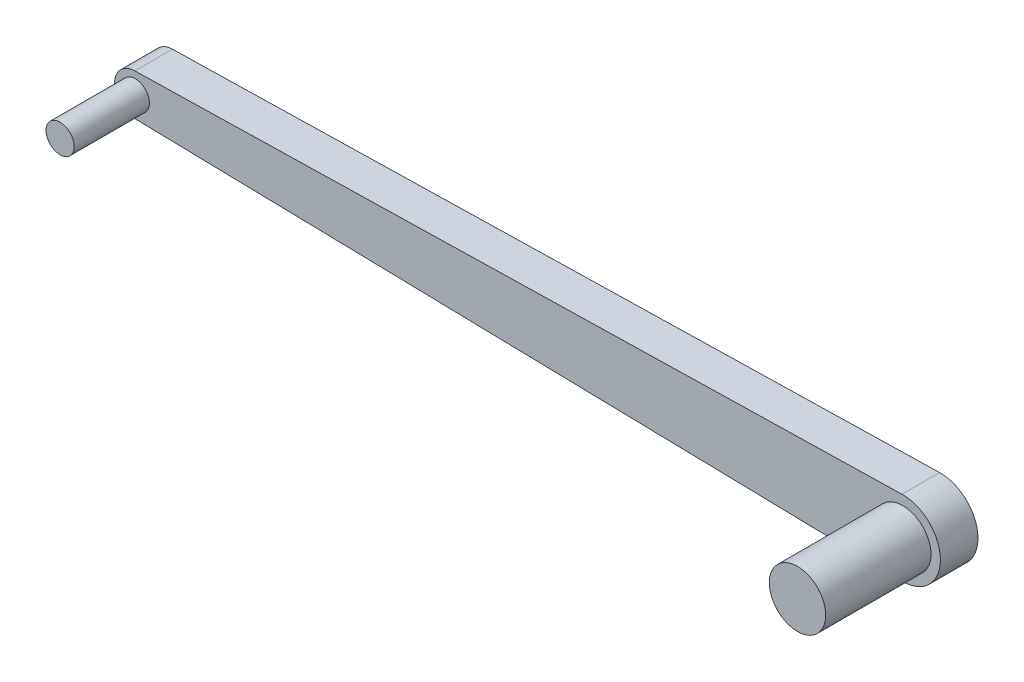
ISO-10303-21;
HEADER;
FILE_DESCRIPTION(('STEP AP214'),'2;1');
FILE_NAME('part.step','',(''),(''),'','','');
FILE_SCHEMA(('AUTOMOTIVE_DESIGN { 1 0 10303 214 1 1 1 1 }'));
ENDSEC;
DATA;
#1=APPLICATION_CONTEXT('core data for automotive mechanical design processes');
#2=APPLICATION_PROTOCOL_DEFINITION('international standard','automotive_design',2000,#1);
#3=PRODUCT_CONTEXT('',#1,'mechanical');
#4=PRODUCT('Part','Part','',(#3));
#5=PRODUCT_RELATED_PRODUCT_CATEGORY('part','',(#4));
#6=PRODUCT_DEFINITION_FORMATION('','',#4);
#7=PRODUCT_DEFINITION_CONTEXT('part definition',#1,'design');
#8=PRODUCT_DEFINITION('design','',#6,#7);
#9=PRODUCT_DEFINITION_SHAPE('','',#8);
#10=(LENGTH_UNIT() NAMED_UNIT(*) SI_UNIT(.MILLI.,.METRE.));
#11=(NAMED_UNIT(*) PLANE_ANGLE_UNIT() SI_UNIT($,.RADIAN.));
#12=(NAMED_UNIT(*) SI_UNIT($,.STERADIAN.) SOLID_ANGLE_UNIT());
#13=UNCERTAINTY_MEASURE_WITH_UNIT(LENGTH_MEASURE(1.E-05),#10,'distance_accuracy_value','');
#14=(GEOMETRIC_REPRESENTATION_CONTEXT(3) GLOBAL_UNCERTAINTY_ASSIGNED_CONTEXT((#13)) GLOBAL_UNIT_ASSIGNED_CONTEXT((#10,
#11,#12)) REPRESENTATION_CONTEXT('',''));
#15=CARTESIAN_POINT('',(0.,0.,0.));
#16=DIRECTION('',(0.,0.,1.));
#17=DIRECTION('',(1.,0.,0.));
#18=AXIS2_PLACEMENT_3D('',#15,#16,#17);
#19=CARTESIAN_POINT('',(-10.205,0.,0.5));
#20=DIRECTION('',(0.,0.,1.));
#21=DIRECTION('',(1.,0.,0.));
#22=AXIS2_PLACEMENT_3D('',#19,#20,#21);
#23=PLANE('',#22);
#24=CARTESIAN_POINT('',(-10.205,0.,0.5));
#25=DIRECTION('',(0.,0.,1.));
#26=DIRECTION('',(1.,0.,0.));
#27=AXIS2_PLACEMENT_3D('',#24,#25,#26);
#28=CIRCLE('',#27,0.375000000000001);
#29=CARTESIAN_POINT('',(-9.83,0.,0.5));
#30=VERTEX_POINT('',#29);
#31=EDGE_CURVE('E108',#30,#30,#28,.T.);
#32=ORIENTED_EDGE('',*,*,#31,.F.);
#33=EDGE_LOOP('',(#32));
#34=FACE_BOUND('',#33,.T.);
#35=CARTESIAN_POINT('',(-10.205,0.,0.5));
#36=DIRECTION('',(0.,0.,1.));
#37=DIRECTION('',(1.,0.,0.));
#38=AXIS2_PLACEMENT_3D('',#35,#36,#37);
#39=CIRCLE('',#38,0.55);
#40=CARTESIAN_POINT('',(-10.2171264086232,0.549866302126165,0.5));
#41=VERTEX_POINT('',#40);
#42=CARTESIAN_POINT('',(-10.2171264086232,-0.549866302126165,0.5));
#43=VERTEX_POINT('',#42);
#44=EDGE_CURVE('E93',#41,#43,#39,.T.);
#45=ORIENTED_EDGE('',*,*,#44,.T.);
#46=DIRECTION('',(0.999756912956663,-0.0220480156785887,0.));
#47=VECTOR('',#46,1.);
#48=CARTESIAN_POINT('',(-10.2171264086232,-0.549866302126165,0.5));
#49=LINE('',#48,#47);
#50=CARTESIAN_POINT('',(10.1829519843214,-0.99975691295666,0.5));
#51=VERTEX_POINT('',#50);
#52=EDGE_CURVE('E88',#43,#51,#49,.T.);
#53=ORIENTED_EDGE('',*,*,#52,.T.);
#54=CARTESIAN_POINT('',(10.205,0.,0.5));
#55=DIRECTION('',(0.,0.,1.));
#56=DIRECTION('',(1.,0.,0.));
#57=AXIS2_PLACEMENT_3D('',#54,#55,#56);
#58=CIRCLE('',#57,1.);
#59=CARTESIAN_POINT('',(10.1829519843214,0.999756912956667,0.5));
#60=VERTEX_POINT('',#59);
#61=EDGE_CURVE('E91',#51,#60,#58,.T.);
#62=ORIENTED_EDGE('',*,*,#61,.T.);
#63=DIRECTION('',(-0.999756912956663,-0.0220480156785891,0.));
#64=VECTOR('',#63,1.);
#65=CARTESIAN_POINT('',(-10.2171264086232,0.549866302126165,0.5));
#66=LINE('',#65,#64);
#67=EDGE_CURVE('E58',#60,#41,#66,.T.);
#68=ORIENTED_EDGE('',*,*,#67,.T.);
#69=EDGE_LOOP('',(#45,#53,#62,#68));
#70=FACE_BOUND('',#69,.T.);
#71=CARTESIAN_POINT('',(10.205,0.,0.5));
#72=DIRECTION('',(0.,0.,1.));
#73=DIRECTION('',(1.,0.,0.));
#74=AXIS2_PLACEMENT_3D('',#71,#72,#73);
#75=CIRCLE('',#74,0.75);
#76=CARTESIAN_POINT('',(10.955,0.,0.5));
#77=VERTEX_POINT('',#76);
#78=EDGE_CURVE('E121',#77,#77,#75,.T.);
#79=ORIENTED_EDGE('',*,*,#78,.F.);
#80=EDGE_LOOP('',(#79));
#81=FACE_BOUND('',#80,.T.);
#82=ADVANCED_FACE('F41',(#34,#70,#81),#23,.T.);
#83=CARTESIAN_POINT('',(-10.205,0.,-0.5));
#84=DIRECTION('',(0.,0.,1.));
#85=DIRECTION('',(1.,0.,0.));
#86=AXIS2_PLACEMENT_3D('',#83,#84,#85);
#87=PLANE('',#86);
#88=CARTESIAN_POINT('',(-10.205,0.,-0.5));
#89=DIRECTION('',(0.,0.,1.));
#90=DIRECTION('',(1.,0.,0.));
#91=AXIS2_PLACEMENT_3D('',#88,#89,#90);
#92=CIRCLE('',#91,0.55);
#93=CARTESIAN_POINT('',(-10.2171264086232,0.549866302126165,-0.5));
#94=VERTEX_POINT('',#93);
#95=CARTESIAN_POINT('',(-10.2171264086232,-0.549866302126165,-0.5));
#96=VERTEX_POINT('',#95);
#97=EDGE_CURVE('E105',#94,#96,#92,.T.);
#98=ORIENTED_EDGE('',*,*,#97,.F.);
#99=DIRECTION('',(-0.999756912956663,-0.0220480156785891,0.));
#100=VECTOR('',#99,1.);
#101=CARTESIAN_POINT('',(-10.2171264086232,0.549866302126165,-0.5));
#102=LINE('',#101,#100);
#103=CARTESIAN_POINT('',(10.1829519843214,0.999756912956667,-0.5));
#104=VERTEX_POINT('',#103);
#105=EDGE_CURVE('E81',#104,#94,#102,.T.);
#106=ORIENTED_EDGE('',*,*,#105,.F.);
#107=CARTESIAN_POINT('',(10.205,0.,-0.5));
#108=DIRECTION('',(0.,0.,1.));
#109=DIRECTION('',(1.,0.,0.));
#110=AXIS2_PLACEMENT_3D('',#107,#108,#109);
#111=CIRCLE('',#110,1.);
#112=CARTESIAN_POINT('',(10.1829519843214,-0.99975691295666,-0.5));
#113=VERTEX_POINT('',#112);
#114=EDGE_CURVE('E75',#113,#104,#111,.T.);
#115=ORIENTED_EDGE('',*,*,#114,.F.);
#116=DIRECTION('',(0.999756912956663,-0.0220480156785887,0.));
#117=VECTOR('',#116,1.);
#118=CARTESIAN_POINT('',(-10.2171264086232,-0.549866302126165,-0.5));
#119=LINE('',#118,#117);
#120=EDGE_CURVE('E97',#96,#113,#119,.T.);
#121=ORIENTED_EDGE('',*,*,#120,.F.);
#122=EDGE_LOOP('',(#98,#106,#115,#121));
#123=FACE_BOUND('',#122,.T.);
#124=ADVANCED_FACE('F116',(#123),#87,.F.);
#125=CARTESIAN_POINT('',(-10.205,0.,0.5));
#126=DIRECTION('',(0.,0.,-1.));
#127=DIRECTION('',(-1.,0.,0.));
#128=AXIS2_PLACEMENT_3D('',#125,#126,#127);
#129=CYLINDRICAL_SURFACE('',#128,0.55);
#130=ORIENTED_EDGE('',*,*,#97,.T.);
#131=DIRECTION('',(0.,0.,-1.));
#132=VECTOR('',#131,1.);
#133=CARTESIAN_POINT('',(-10.2171264086232,-0.549866302126165,0.5));
#134=LINE('',#133,#132);
#135=EDGE_CURVE('E11',#43,#96,#134,.T.);
#136=ORIENTED_EDGE('',*,*,#135,.F.);
#137=ORIENTED_EDGE('',*,*,#44,.F.);
#138=DIRECTION('',(0.,0.,-1.));
#139=VECTOR('',#138,1.);
#140=CARTESIAN_POINT('',(-10.2171264086232,0.549866302126165,0.5));
#141=LINE('',#140,#139);
#142=EDGE_CURVE('E101',#41,#94,#141,.T.);
#143=ORIENTED_EDGE('',*,*,#142,.T.);
#144=EDGE_LOOP('',(#130,#136,#137,#143));
#145=FACE_BOUND('',#144,.T.);
#146=ADVANCED_FACE('F43',(#145),#129,.T.);
#147=CARTESIAN_POINT('',(-10.2171264086232,-0.549866302126165,0.5));
#148=DIRECTION('',(0.0220480156785887,0.999756912956663,0.));
#149=DIRECTION('',(-0.999756912956663,0.0220480156785887,0.));
#150=AXIS2_PLACEMENT_3D('',#147,#148,#149);
#151=PLANE('',#150);
#152=ORIENTED_EDGE('',*,*,#120,.T.);
#153=DIRECTION('',(0.,0.,-1.));
#154=VECTOR('',#153,1.);
#155=CARTESIAN_POINT('',(10.1829519843214,-0.99975691295666,0.5));
#156=LINE('',#155,#154);
#157=EDGE_CURVE('E50',#51,#113,#156,.T.);
#158=ORIENTED_EDGE('',*,*,#157,.F.);
#159=ORIENTED_EDGE('',*,*,#52,.F.);
#160=ORIENTED_EDGE('',*,*,#135,.T.);
#161=EDGE_LOOP('',(#152,#158,#159,#160));
#162=FACE_BOUND('',#161,.T.);
#163=ADVANCED_FACE('F96',(#162),#151,.F.);
#164=CARTESIAN_POINT('',(10.205,0.,0.5));
#165=DIRECTION('',(0.,0.,-1.));
#166=DIRECTION('',(-1.,0.,0.));
#167=AXIS2_PLACEMENT_3D('',#164,#165,#166);
#168=CYLINDRICAL_SURFACE('',#167,1.);
#169=ORIENTED_EDGE('',*,*,#114,.T.);
#170=DIRECTION('',(0.,0.,-1.));
#171=VECTOR('',#170,1.);
#172=CARTESIAN_POINT('',(10.1829519843214,0.999756912956667,0.5));
#173=LINE('',#172,#171);
#174=EDGE_CURVE('E98',#60,#104,#173,.T.);
#175=ORIENTED_EDGE('',*,*,#174,.F.);
#176=ORIENTED_EDGE('',*,*,#61,.F.);
#177=ORIENTED_EDGE('',*,*,#157,.T.);
#178=EDGE_LOOP('',(#169,#175,#176,#177));
#179=FACE_BOUND('',#178,.T.);
#180=ADVANCED_FACE('F99',(#179),#168,.T.);
#181=CARTESIAN_POINT('',(-10.2171264086232,0.549866302126165,0.5));
#182=DIRECTION('',(0.0220480156785891,-0.999756912956663,0.));
#183=DIRECTION('',(0.999756912956663,0.0220480156785891,0.));
#184=AXIS2_PLACEMENT_3D('',#181,#182,#183);
#185=PLANE('',#184);
#186=ORIENTED_EDGE('',*,*,#105,.T.);
#187=ORIENTED_EDGE('',*,*,#142,.F.);
#188=ORIENTED_EDGE('',*,*,#67,.F.);
#189=ORIENTED_EDGE('',*,*,#174,.T.);
#190=EDGE_LOOP('',(#186,#187,#188,#189));
#191=FACE_BOUND('',#190,.T.);
#192=ADVANCED_FACE('F113',(#191),#185,.F.);
#193=CARTESIAN_POINT('',(-10.205,0.,2.5));
#194=DIRECTION('',(0.,0.,-1.));
#195=DIRECTION('',(-1.,0.,0.));
#196=AXIS2_PLACEMENT_3D('',#193,#194,#195);
#197=CYLINDRICAL_SURFACE('',#196,0.375000000000001);
#198=ORIENTED_EDGE('',*,*,#31,.T.);
#199=EDGE_LOOP('',(#198));
#200=FACE_BOUND('',#199,.T.);
#201=CARTESIAN_POINT('',(-10.205,0.,2.5));
#202=DIRECTION('',(0.,0.,1.));
#203=DIRECTION('',(1.,0.,0.));
#204=AXIS2_PLACEMENT_3D('',#201,#202,#203);
#205=CIRCLE('',#204,0.375000000000001);
#206=CARTESIAN_POINT('',(-9.83,0.,2.5));
#207=VERTEX_POINT('',#206);
#208=EDGE_CURVE('E124',#207,#207,#205,.T.);
#209=ORIENTED_EDGE('',*,*,#208,.F.);
#210=EDGE_LOOP('',(#209));
#211=FACE_BOUND('',#210,.T.);
#212=ADVANCED_FACE('F143',(#200,#211),#197,.T.);
#213=CARTESIAN_POINT('',(0.,0.,2.5));
#214=DIRECTION('',(0.,0.,1.));
#215=DIRECTION('',(1.,0.,0.));
#216=AXIS2_PLACEMENT_3D('',#213,#214,#215);
#217=PLANE('',#216);
#218=ORIENTED_EDGE('',*,*,#208,.T.);
#219=EDGE_LOOP('',(#218));
#220=FACE_BOUND('',#219,.T.);
#221=ADVANCED_FACE('F135',(#220),#217,.T.);
#222=CARTESIAN_POINT('',(10.205,0.,3.3));
#223=DIRECTION('',(0.,0.,-1.));
#224=DIRECTION('',(-1.,0.,0.));
#225=AXIS2_PLACEMENT_3D('',#222,#223,#224);
#226=CYLINDRICAL_SURFACE('',#225,0.75);
#227=ORIENTED_EDGE('',*,*,#78,.T.);
#228=EDGE_LOOP('',(#227));
#229=FACE_BOUND('',#228,.T.);
#230=CARTESIAN_POINT('',(10.205,0.,3.3));
#231=DIRECTION('',(0.,0.,1.));
#232=DIRECTION('',(1.,0.,0.));
#233=AXIS2_PLACEMENT_3D('',#230,#231,#232);
#234=CIRCLE('',#233,0.75);
#235=CARTESIAN_POINT('',(10.955,0.,3.3));
#236=VERTEX_POINT('',#235);
#237=EDGE_CURVE('E127',#236,#236,#234,.T.);
#238=ORIENTED_EDGE('',*,*,#237,.F.);
#239=EDGE_LOOP('',(#238));
#240=FACE_BOUND('',#239,.T.);
#241=ADVANCED_FACE('F133',(#229,#240),#226,.T.);
#242=CARTESIAN_POINT('',(0.,0.,3.3));
#243=DIRECTION('',(0.,0.,1.));
#244=DIRECTION('',(1.,0.,0.));
#245=AXIS2_PLACEMENT_3D('',#242,#243,#244);
#246=PLANE('',#245);
#247=ORIENTED_EDGE('',*,*,#237,.T.);
#248=EDGE_LOOP('',(#247));
#249=FACE_BOUND('',#248,.T.);
#250=ADVANCED_FACE('F131',(#249),#246,.T.);
#251=CLOSED_SHELL('',(#82,#124,#146,#163,#180,#192,#212,#221,#241,#250));
#252=MANIFOLD_SOLID_BREP('B2',#251);
#253=ADVANCED_BREP_SHAPE_REPRESENTATION('',(#18,#252),#14);
#254=SHAPE_DEFINITION_REPRESENTATION(#9,#253);
ENDSEC;
END-ISO-10303-21;
